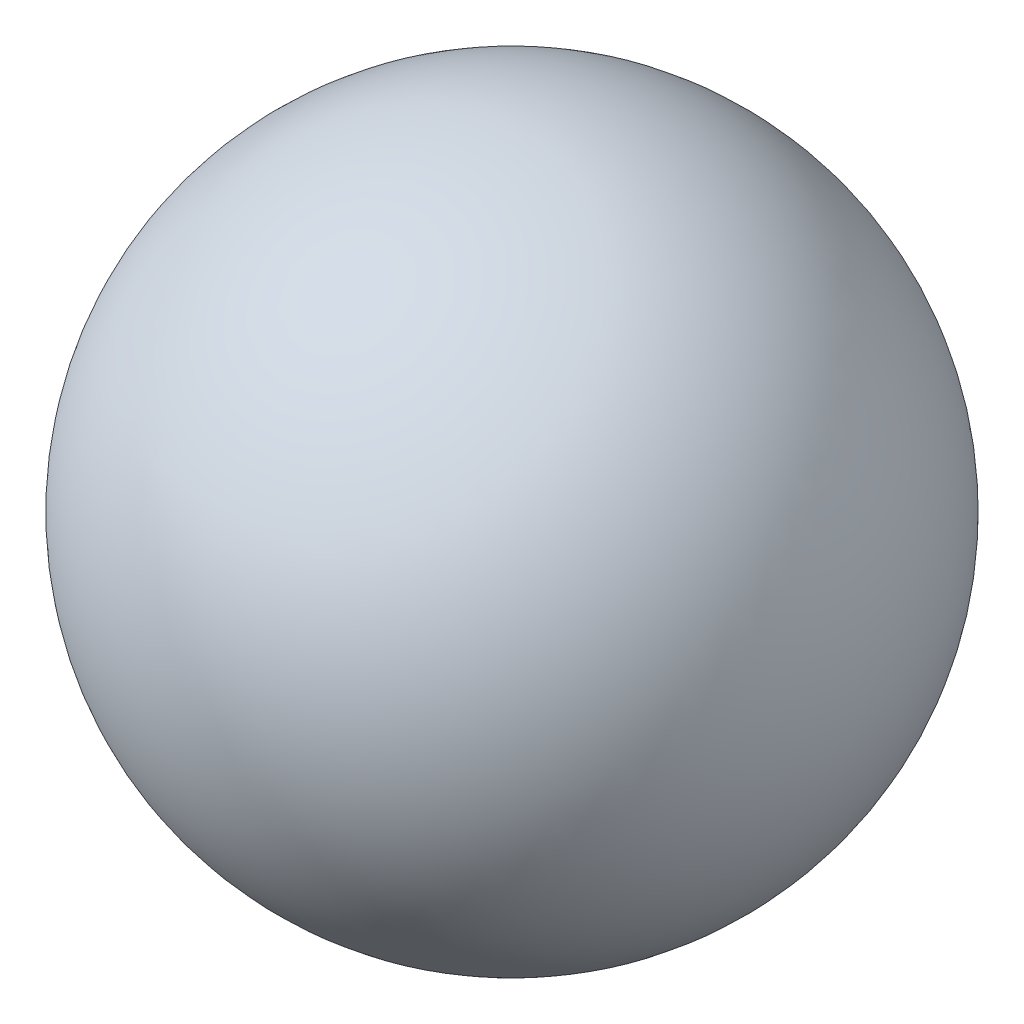
ISO-10303-21;
HEADER;
FILE_DESCRIPTION(('STEP AP214'),'2;1');
FILE_NAME('part.step','',(''),(''),'','','');
FILE_SCHEMA(('AUTOMOTIVE_DESIGN { 1 0 10303 214 1 1 1 1 }'));
ENDSEC;
DATA;
#1=APPLICATION_CONTEXT('core data for automotive mechanical design processes');
#2=APPLICATION_PROTOCOL_DEFINITION('international standard','automotive_design',2000,#1);
#3=PRODUCT_CONTEXT('',#1,'mechanical');
#4=PRODUCT('Part','Part','',(#3));
#5=PRODUCT_RELATED_PRODUCT_CATEGORY('part','',(#4));
#6=PRODUCT_DEFINITION_FORMATION('','',#4);
#7=PRODUCT_DEFINITION_CONTEXT('part definition',#1,'design');
#8=PRODUCT_DEFINITION('design','',#6,#7);
#9=PRODUCT_DEFINITION_SHAPE('','',#8);
#10=(LENGTH_UNIT() NAMED_UNIT(*) SI_UNIT(.MILLI.,.METRE.));
#11=(NAMED_UNIT(*) PLANE_ANGLE_UNIT() SI_UNIT($,.RADIAN.));
#12=(NAMED_UNIT(*) SI_UNIT($,.STERADIAN.) SOLID_ANGLE_UNIT());
#13=UNCERTAINTY_MEASURE_WITH_UNIT(LENGTH_MEASURE(1.E-05),#10,'distance_accuracy_value','');
#14=(GEOMETRIC_REPRESENTATION_CONTEXT(3) GLOBAL_UNCERTAINTY_ASSIGNED_CONTEXT((#13)) GLOBAL_UNIT_ASSIGNED_CONTEXT((#10,
#11,#12)) REPRESENTATION_CONTEXT('',''));
#15=CARTESIAN_POINT('',(0.,0.,0.));
#16=DIRECTION('',(0.,0.,1.));
#17=DIRECTION('',(1.,0.,0.));
#18=AXIS2_PLACEMENT_3D('',#15,#16,#17);
#19=CARTESIAN_POINT('',(0.,0.,0.));
#20=DIRECTION('',(0.,-1.,0.));
#21=DIRECTION('',(-1.,0.,0.));
#22=AXIS2_PLACEMENT_3D('',#19,#20,#21);
#23=SPHERICAL_SURFACE('',#22,0.5);
#24=CARTESIAN_POINT('',(0.,-0.5,0.));
#25=VERTEX_POINT('',#24);
#26=VERTEX_LOOP('',#25);
#27=FACE_BOUND('',#26,.T.);
#28=ADVANCED_FACE('F29',(#27),#23,.T.);
#29=CLOSED_SHELL('',(#28));
#30=MANIFOLD_SOLID_BREP('B2',#29);
#31=ADVANCED_BREP_SHAPE_REPRESENTATION('',(#18,#30),#14);
#32=SHAPE_DEFINITION_REPRESENTATION(#9,#31);
ENDSEC;
END-ISO-10303-21;
